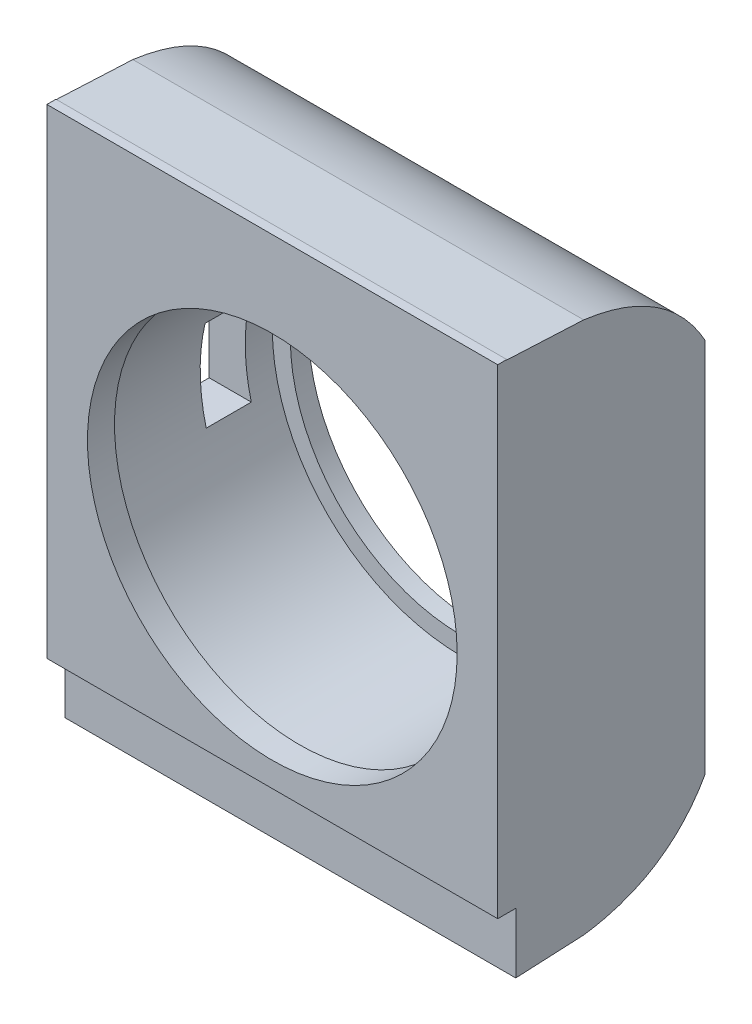
ISO-10303-21;
HEADER;
FILE_DESCRIPTION(('STEP AP214'),'2;1');
FILE_NAME('part.step','',(''),(''),'','','');
FILE_SCHEMA(('AUTOMOTIVE_DESIGN { 1 0 10303 214 1 1 1 1 }'));
ENDSEC;
DATA;
#1=APPLICATION_CONTEXT('core data for automotive mechanical design processes');
#2=APPLICATION_PROTOCOL_DEFINITION('international standard','automotive_design',2000,#1);
#3=PRODUCT_CONTEXT('',#1,'mechanical');
#4=PRODUCT('Part','Part','',(#3));
#5=PRODUCT_RELATED_PRODUCT_CATEGORY('part','',(#4));
#6=PRODUCT_DEFINITION_FORMATION('','',#4);
#7=PRODUCT_DEFINITION_CONTEXT('part definition',#1,'design');
#8=PRODUCT_DEFINITION('design','',#6,#7);
#9=PRODUCT_DEFINITION_SHAPE('','',#8);
#10=(LENGTH_UNIT() NAMED_UNIT(*) SI_UNIT(.MILLI.,.METRE.));
#11=(NAMED_UNIT(*) PLANE_ANGLE_UNIT() SI_UNIT($,.RADIAN.));
#12=(NAMED_UNIT(*) SI_UNIT($,.STERADIAN.) SOLID_ANGLE_UNIT());
#13=UNCERTAINTY_MEASURE_WITH_UNIT(LENGTH_MEASURE(1.E-05),#10,'distance_accuracy_value','');
#14=(GEOMETRIC_REPRESENTATION_CONTEXT(3) GLOBAL_UNCERTAINTY_ASSIGNED_CONTEXT((#13)) GLOBAL_UNIT_ASSIGNED_CONTEXT((#10,
#11,#12)) REPRESENTATION_CONTEXT('',''));
#15=CARTESIAN_POINT('',(0.,0.,0.));
#16=DIRECTION('',(0.,0.,1.));
#17=DIRECTION('',(1.,0.,0.));
#18=AXIS2_PLACEMENT_3D('',#15,#16,#17);
#19=CARTESIAN_POINT('',(25.,30.,23.));
#20=DIRECTION('',(-1.,0.,0.));
#21=DIRECTION('',(0.,-1.,0.));
#22=AXIS2_PLACEMENT_3D('',#19,#20,#21);
#23=PLANE('',#22);
#24=DIRECTION('',(0.,0.,-1.));
#25=VECTOR('',#24,1.);
#26=CARTESIAN_POINT('',(25.,-23.2102553070642,0.));
#27=LINE('',#26,#25);
#28=CARTESIAN_POINT('',(25.,-23.2102553070642,23.));
#29=VERTEX_POINT('',#28);
#30=CARTESIAN_POINT('',(25.,-23.2102553070642,21.));
#31=VERTEX_POINT('',#30);
#32=EDGE_CURVE('E156',#29,#31,#27,.T.);
#33=ORIENTED_EDGE('',*,*,#32,.T.);
#34=DIRECTION('',(0.,1.,0.));
#35=VECTOR('',#34,1.);
#36=CARTESIAN_POINT('',(25.,0.,21.));
#37=LINE('',#36,#35);
#38=CARTESIAN_POINT('',(25.,-29.9040562600047,21.));
#39=VERTEX_POINT('',#38);
#40=EDGE_CURVE('E147',#39,#31,#37,.T.);
#41=ORIENTED_EDGE('',*,*,#40,.F.);
#42=DIRECTION('',(0.,-0.0479167662474689,0.998851332037148));
#43=VECTOR('',#42,1.);
#44=CARTESIAN_POINT('',(25.,-29.5427998082037,13.4694106813302));
#45=LINE('',#44,#43);
#46=CARTESIAN_POINT('',(25.,-29.5427998082037,13.4694106813302));
#47=VERTEX_POINT('',#46);
#48=EDGE_CURVE('E284',#47,#39,#45,.T.);
#49=ORIENTED_EDGE('',*,*,#48,.F.);
#50=CARTESIAN_POINT('',(25.,-20.8431990397707,0.));
#51=CARTESIAN_POINT('',(25.,-28.2896883248181,4.17100932371175));
#52=CARTESIAN_POINT('',(25.,-29.5427998082037,13.4694106813302));
#53=B_SPLINE_CURVE_WITH_KNOTS('',2,(#50,#51,#52),.UNSPECIFIED.,.F.,.F.,(3,3),(0.,1.),.UNSPECIFIED.);
#54=CARTESIAN_POINT('',(25.,-20.8431990397707,0.));
#55=VERTEX_POINT('',#54);
#56=EDGE_CURVE('E230',#55,#47,#53,.T.);
#57=ORIENTED_EDGE('',*,*,#56,.F.);
#58=DIRECTION('',(0.,1.,0.));
#59=VECTOR('',#58,1.);
#60=CARTESIAN_POINT('',(25.,30.,0.));
#61=LINE('',#60,#59);
#62=CARTESIAN_POINT('',(25.,20.8431990397707,0.));
#63=VERTEX_POINT('',#62);
#64=EDGE_CURVE('E301',#55,#63,#61,.T.);
#65=ORIENTED_EDGE('',*,*,#64,.T.);
#66=CARTESIAN_POINT('',(25.,29.5427998082037,13.4694106813302));
#67=CARTESIAN_POINT('',(25.,28.289688324818,4.17100932371175));
#68=CARTESIAN_POINT('',(25.,20.8431990397707,0.));
#69=B_SPLINE_CURVE_WITH_KNOTS('',2,(#66,#67,#68),.UNSPECIFIED.,.F.,.F.,(3,3),(0.,1.),.UNSPECIFIED.);
#70=CARTESIAN_POINT('',(25.,29.5427998082037,13.4694106813302));
#71=VERTEX_POINT('',#70);
#72=EDGE_CURVE('E231',#71,#63,#69,.T.);
#73=ORIENTED_EDGE('',*,*,#72,.F.);
#74=DIRECTION('',(0.,-0.0479167662474689,-0.998851332037148));
#75=VECTOR('',#74,1.);
#76=CARTESIAN_POINT('',(25.,29.5427998082037,13.4694106813302));
#77=LINE('',#76,#75);
#78=CARTESIAN_POINT('',(25.,29.9520281300023,22.));
#79=VERTEX_POINT('',#78);
#80=EDGE_CURVE('E236',#79,#71,#77,.T.);
#81=ORIENTED_EDGE('',*,*,#80,.F.);
#82=DIRECTION('',(0.,-1.,0.));
#83=VECTOR('',#82,1.);
#84=CARTESIAN_POINT('',(25.,0.,22.));
#85=LINE('',#84,#83);
#86=CARTESIAN_POINT('',(25.,30.,22.));
#87=VERTEX_POINT('',#86);
#88=EDGE_CURVE('E184',#87,#79,#85,.T.);
#89=ORIENTED_EDGE('',*,*,#88,.F.);
#90=DIRECTION('',(0.,0.,-1.));
#91=VECTOR('',#90,1.);
#92=CARTESIAN_POINT('',(25.,30.,27.));
#93=LINE('',#92,#91);
#94=CARTESIAN_POINT('',(25.,30.,23.));
#95=VERTEX_POINT('',#94);
#96=EDGE_CURVE('E199',#95,#87,#93,.T.);
#97=ORIENTED_EDGE('',*,*,#96,.F.);
#98=DIRECTION('',(0.,1.,0.));
#99=VECTOR('',#98,1.);
#100=CARTESIAN_POINT('',(25.,30.,23.));
#101=LINE('',#100,#99);
#102=EDGE_CURVE('E169',#29,#95,#101,.T.);
#103=ORIENTED_EDGE('',*,*,#102,.F.);
#104=EDGE_LOOP('',(#33,#41,#49,#57,#65,#73,#81,#89,#97,#103));
#105=FACE_BOUND('',#104,.T.);
#106=ADVANCED_FACE('F47',(#105),#23,.F.);
#107=CARTESIAN_POINT('',(-25.,30.,23.));
#108=DIRECTION('',(1.,0.,0.));
#109=DIRECTION('',(0.,1.,0.));
#110=AXIS2_PLACEMENT_3D('',#107,#108,#109);
#111=PLANE('',#110);
#112=DIRECTION('',(0.,0.,-1.));
#113=VECTOR('',#112,1.);
#114=CARTESIAN_POINT('',(-25.,-5.25747370794527,23.));
#115=LINE('',#114,#113);
#116=CARTESIAN_POINT('',(-25.,-5.25747370794527,10.));
#117=VERTEX_POINT('',#116);
#118=CARTESIAN_POINT('',(-25.,-5.25747370794527,5.));
#119=VERTEX_POINT('',#118);
#120=EDGE_CURVE('E336',#117,#119,#115,.T.);
#121=ORIENTED_EDGE('',*,*,#120,.T.);
#122=DIRECTION('',(0.,1.,0.));
#123=VECTOR('',#122,1.);
#124=CARTESIAN_POINT('',(-25.,30.,5.));
#125=LINE('',#124,#123);
#126=CARTESIAN_POINT('',(-25.,4.74252629205473,5.));
#127=VERTEX_POINT('',#126);
#128=EDGE_CURVE('E340',#119,#127,#125,.T.);
#129=ORIENTED_EDGE('',*,*,#128,.T.);
#130=DIRECTION('',(0.,0.,1.));
#131=VECTOR('',#130,1.);
#132=CARTESIAN_POINT('',(-25.,4.74252629205473,23.));
#133=LINE('',#132,#131);
#134=CARTESIAN_POINT('',(-25.,4.74252629205473,10.));
#135=VERTEX_POINT('',#134);
#136=EDGE_CURVE('E328',#127,#135,#133,.T.);
#137=ORIENTED_EDGE('',*,*,#136,.T.);
#138=DIRECTION('',(0.,-1.,0.));
#139=VECTOR('',#138,1.);
#140=CARTESIAN_POINT('',(-25.,30.,10.));
#141=LINE('',#140,#139);
#142=EDGE_CURVE('E332',#135,#117,#141,.T.);
#143=ORIENTED_EDGE('',*,*,#142,.T.);
#144=EDGE_LOOP('',(#121,#129,#137,#143));
#145=FACE_BOUND('',#144,.T.);
#146=DIRECTION('',(0.,0.,-1.));
#147=VECTOR('',#146,1.);
#148=CARTESIAN_POINT('',(-25.,-23.2102553070642,0.));
#149=LINE('',#148,#147);
#150=CARTESIAN_POINT('',(-25.,-23.2102553070642,23.));
#151=VERTEX_POINT('',#150);
#152=CARTESIAN_POINT('',(-25.,-23.2102553070642,21.));
#153=VERTEX_POINT('',#152);
#154=EDGE_CURVE('E163',#151,#153,#149,.T.);
#155=ORIENTED_EDGE('',*,*,#154,.F.);
#156=DIRECTION('',(0.,-1.,0.));
#157=VECTOR('',#156,1.);
#158=CARTESIAN_POINT('',(-25.,30.,23.));
#159=LINE('',#158,#157);
#160=CARTESIAN_POINT('',(-25.,30.,23.));
#161=VERTEX_POINT('',#160);
#162=EDGE_CURVE('E320',#161,#151,#159,.T.);
#163=ORIENTED_EDGE('',*,*,#162,.F.);
#164=DIRECTION('',(0.,0.,-1.));
#165=VECTOR('',#164,1.);
#166=CARTESIAN_POINT('',(-25.,30.,27.));
#167=LINE('',#166,#165);
#168=CARTESIAN_POINT('',(-25.,30.,22.));
#169=VERTEX_POINT('',#168);
#170=EDGE_CURVE('E196',#161,#169,#167,.T.);
#171=ORIENTED_EDGE('',*,*,#170,.T.);
#172=DIRECTION('',(0.,-1.,0.));
#173=VECTOR('',#172,1.);
#174=CARTESIAN_POINT('',(-25.,0.,22.));
#175=LINE('',#174,#173);
#176=CARTESIAN_POINT('',(-25.,29.9520281300023,22.));
#177=VERTEX_POINT('',#176);
#178=EDGE_CURVE('E192',#169,#177,#175,.T.);
#179=ORIENTED_EDGE('',*,*,#178,.T.);
#180=DIRECTION('',(0.,-0.0479167662474689,-0.998851332037148));
#181=VECTOR('',#180,1.);
#182=CARTESIAN_POINT('',(-25.,29.5427998082037,13.4694106813302));
#183=LINE('',#182,#181);
#184=CARTESIAN_POINT('',(-25.,29.5427998082037,13.4694106813302));
#185=VERTEX_POINT('',#184);
#186=EDGE_CURVE('E250',#177,#185,#183,.T.);
#187=ORIENTED_EDGE('',*,*,#186,.T.);
#188=CARTESIAN_POINT('',(-25.,29.5427998082037,13.4694106813302));
#189=CARTESIAN_POINT('',(-25.,28.289688324818,4.17100932371175));
#190=CARTESIAN_POINT('',(-25.,20.8431990397707,0.));
#191=B_SPLINE_CURVE_WITH_KNOTS('',2,(#188,#189,#190),.UNSPECIFIED.,.F.,.F.,(3,3),(0.,1.),.UNSPECIFIED.);
#192=CARTESIAN_POINT('',(-25.,20.8431990397707,0.));
#193=VERTEX_POINT('',#192);
#194=EDGE_CURVE('E243',#185,#193,#191,.T.);
#195=ORIENTED_EDGE('',*,*,#194,.T.);
#196=DIRECTION('',(0.,-1.,0.));
#197=VECTOR('',#196,1.);
#198=CARTESIAN_POINT('',(-25.,30.,0.));
#199=LINE('',#198,#197);
#200=CARTESIAN_POINT('',(-25.,-20.8431990397707,0.));
#201=VERTEX_POINT('',#200);
#202=EDGE_CURVE('E297',#193,#201,#199,.T.);
#203=ORIENTED_EDGE('',*,*,#202,.T.);
#204=CARTESIAN_POINT('',(-25.,-20.8431990397707,0.));
#205=CARTESIAN_POINT('',(-25.,-28.2896883248181,4.17100932371175));
#206=CARTESIAN_POINT('',(-25.,-29.5427998082037,13.4694106813302));
#207=B_SPLINE_CURVE_WITH_KNOTS('',2,(#204,#205,#206),.UNSPECIFIED.,.F.,.F.,(3,3),(0.,1.),.UNSPECIFIED.);
#208=CARTESIAN_POINT('',(-25.,-29.5427998082037,13.4694106813302));
#209=VERTEX_POINT('',#208);
#210=EDGE_CURVE('E275',#201,#209,#207,.T.);
#211=ORIENTED_EDGE('',*,*,#210,.T.);
#212=DIRECTION('',(0.,-0.0479167662474689,0.998851332037148));
#213=VECTOR('',#212,1.);
#214=CARTESIAN_POINT('',(-25.,-29.5427998082037,13.4694106813302));
#215=LINE('',#214,#213);
#216=CARTESIAN_POINT('',(-25.,-29.9040562600047,21.));
#217=VERTEX_POINT('',#216);
#218=EDGE_CURVE('E283',#209,#217,#215,.T.);
#219=ORIENTED_EDGE('',*,*,#218,.T.);
#220=DIRECTION('',(0.,1.,0.));
#221=VECTOR('',#220,1.);
#222=CARTESIAN_POINT('',(-25.,0.,21.));
#223=LINE('',#222,#221);
#224=EDGE_CURVE('E64',#217,#153,#223,.T.);
#225=ORIENTED_EDGE('',*,*,#224,.T.);
#226=EDGE_LOOP('',(#155,#163,#171,#179,#187,#195,#203,#211,#219,#225));
#227=FACE_BOUND('',#226,.T.);
#228=ADVANCED_FACE('F351',(#145,#227),#111,.F.);
#229=CARTESIAN_POINT('',(0.,0.,23.));
#230=DIRECTION('',(0.,0.,1.));
#231=DIRECTION('',(1.,0.,0.));
#232=AXIS2_PLACEMENT_3D('',#229,#230,#231);
#233=PLANE('',#232);
#234=CARTESIAN_POINT('',(0.,0.,23.));
#235=DIRECTION('',(0.,0.,1.));
#236=DIRECTION('',(1.,0.,0.));
#237=AXIS2_PLACEMENT_3D('',#234,#235,#236);
#238=CIRCLE('',#237,20.5);
#239=CARTESIAN_POINT('',(20.5,0.,23.));
#240=VERTEX_POINT('',#239);
#241=EDGE_CURVE('E307',#240,#240,#238,.T.);
#242=ORIENTED_EDGE('',*,*,#241,.F.);
#243=EDGE_LOOP('',(#242));
#244=FACE_BOUND('',#243,.T.);
#245=ORIENTED_EDGE('',*,*,#162,.T.);
#246=DIRECTION('',(1.,0.,0.));
#247=VECTOR('',#246,1.);
#248=CARTESIAN_POINT('',(-25.,-23.2102553070642,23.));
#249=LINE('',#248,#247);
#250=EDGE_CURVE('E165',#151,#29,#249,.T.);
#251=ORIENTED_EDGE('',*,*,#250,.T.);
#252=ORIENTED_EDGE('',*,*,#102,.T.);
#253=DIRECTION('',(1.,0.,0.));
#254=VECTOR('',#253,1.);
#255=CARTESIAN_POINT('',(0.,30.,23.));
#256=LINE('',#255,#254);
#257=EDGE_CURVE('E179',#161,#95,#256,.T.);
#258=ORIENTED_EDGE('',*,*,#257,.F.);
#259=EDGE_LOOP('',(#245,#251,#252,#258));
#260=FACE_BOUND('',#259,.T.);
#261=ADVANCED_FACE('F380',(#244,#260),#233,.T.);
#262=CARTESIAN_POINT('',(0.,30.,27.));
#263=DIRECTION('',(0.,1.,0.));
#264=DIRECTION('',(0.,0.,1.));
#265=AXIS2_PLACEMENT_3D('',#262,#263,#264);
#266=PLANE('',#265);
#267=ORIENTED_EDGE('',*,*,#170,.F.);
#268=ORIENTED_EDGE('',*,*,#257,.T.);
#269=ORIENTED_EDGE('',*,*,#96,.T.);
#270=DIRECTION('',(1.,0.,0.));
#271=VECTOR('',#270,1.);
#272=CARTESIAN_POINT('',(0.,30.,22.));
#273=LINE('',#272,#271);
#274=EDGE_CURVE('E188',#169,#87,#273,.T.);
#275=ORIENTED_EDGE('',*,*,#274,.F.);
#276=EDGE_LOOP('',(#267,#268,#269,#275));
#277=FACE_BOUND('',#276,.T.);
#278=ADVANCED_FACE('F356',(#277),#266,.T.);
#279=CARTESIAN_POINT('',(-25.,29.5427998082037,13.4694106813302));
#280=DIRECTION('',(0.,-0.998851332037148,0.0479167662474689));
#281=DIRECTION('',(0.,-0.0479167662474689,-0.998851332037148));
#282=AXIS2_PLACEMENT_3D('',#279,#280,#281);
#283=PLANE('',#282);
#284=DIRECTION('',(-1.,0.,0.));
#285=VECTOR('',#284,1.);
#286=CARTESIAN_POINT('',(-25.,29.9520281300023,22.));
#287=LINE('',#286,#285);
#288=EDGE_CURVE('E57',#79,#177,#287,.T.);
#289=ORIENTED_EDGE('',*,*,#288,.F.);
#290=ORIENTED_EDGE('',*,*,#80,.T.);
#291=DIRECTION('',(1.,0.,0.));
#292=VECTOR('',#291,1.);
#293=CARTESIAN_POINT('',(-25.,29.5427998082037,13.4694106813302));
#294=LINE('',#293,#292);
#295=EDGE_CURVE('E302',#185,#71,#294,.T.);
#296=ORIENTED_EDGE('',*,*,#295,.F.);
#297=ORIENTED_EDGE('',*,*,#186,.F.);
#298=EDGE_LOOP('',(#289,#290,#296,#297));
#299=FACE_BOUND('',#298,.T.);
#300=ADVANCED_FACE('F263',(#299),#283,.F.);
#301=CARTESIAN_POINT('',(0.,0.,2.));
#302=DIRECTION('',(0.,0.,1.));
#303=DIRECTION('',(1.,0.,0.));
#304=AXIS2_PLACEMENT_3D('',#301,#302,#303);
#305=PLANE('',#304);
#306=CARTESIAN_POINT('',(0.,0.,2.));
#307=DIRECTION('',(0.,0.,1.));
#308=DIRECTION('',(1.,0.,0.));
#309=AXIS2_PLACEMENT_3D('',#306,#307,#308);
#310=CIRCLE('',#309,19.);
#311=CARTESIAN_POINT('',(19.,0.,2.));
#312=VERTEX_POINT('',#311);
#313=EDGE_CURVE('E157',#312,#312,#310,.T.);
#314=ORIENTED_EDGE('',*,*,#313,.F.);
#315=EDGE_LOOP('',(#314));
#316=FACE_BOUND('',#315,.T.);
#317=CARTESIAN_POINT('',(0.,0.,2.));
#318=DIRECTION('',(0.,0.,1.));
#319=DIRECTION('',(1.,0.,0.));
#320=AXIS2_PLACEMENT_3D('',#317,#318,#319);
#321=CIRCLE('',#320,21.);
#322=CARTESIAN_POINT('',(21.,0.,2.));
#323=VERTEX_POINT('',#322);
#324=EDGE_CURVE('E324',#323,#323,#321,.F.);
#325=ORIENTED_EDGE('',*,*,#324,.F.);
#326=EDGE_LOOP('',(#325));
#327=FACE_BOUND('',#326,.T.);
#328=ADVANCED_FACE('F401',(#316,#327),#305,.T.);
#329=CARTESIAN_POINT('',(0.,0.,0.));
#330=DIRECTION('',(0.,0.,1.));
#331=DIRECTION('',(1.,0.,0.));
#332=AXIS2_PLACEMENT_3D('',#329,#330,#331);
#333=PLANE('',#332);
#334=CARTESIAN_POINT('',(0.,0.,0.));
#335=DIRECTION('',(0.,0.,1.));
#336=DIRECTION('',(1.,0.,0.));
#337=AXIS2_PLACEMENT_3D('',#334,#335,#336);
#338=CIRCLE('',#337,19.);
#339=CARTESIAN_POINT('',(19.,0.,0.));
#340=VERTEX_POINT('',#339);
#341=EDGE_CURVE('E51',#340,#340,#338,.T.);
#342=ORIENTED_EDGE('',*,*,#341,.T.);
#343=EDGE_LOOP('',(#342));
#344=FACE_BOUND('',#343,.T.);
#345=ORIENTED_EDGE('',*,*,#202,.F.);
#346=DIRECTION('',(1.,0.,0.));
#347=VECTOR('',#346,1.);
#348=CARTESIAN_POINT('',(-25.,20.8431990397707,0.));
#349=LINE('',#348,#347);
#350=EDGE_CURVE('E362',#193,#63,#349,.T.);
#351=ORIENTED_EDGE('',*,*,#350,.T.);
#352=ORIENTED_EDGE('',*,*,#64,.F.);
#353=DIRECTION('',(1.,0.,0.));
#354=VECTOR('',#353,1.);
#355=CARTESIAN_POINT('',(-25.,-20.8431990397707,0.));
#356=LINE('',#355,#354);
#357=EDGE_CURVE('E292',#201,#55,#356,.T.);
#358=ORIENTED_EDGE('',*,*,#357,.F.);
#359=EDGE_LOOP('',(#345,#351,#352,#358));
#360=FACE_BOUND('',#359,.T.);
#361=ADVANCED_FACE('F49',(#344,#360),#333,.F.);
#362=CARTESIAN_POINT('',(0.,0.,20.));
#363=DIRECTION('',(0.,0.,-1.));
#364=DIRECTION('',(-1.,0.,0.));
#365=AXIS2_PLACEMENT_3D('',#362,#363,#364);
#366=CYLINDRICAL_SURFACE('',#365,21.);
#367=CARTESIAN_POINT('',(0.,0.,5.));
#368=DIRECTION('',(0.,0.,-1.));
#369=DIRECTION('',(-1.,0.,0.));
#370=AXIS2_PLACEMENT_3D('',#367,#368,#369);
#371=CIRCLE('',#370,21.);
#372=CARTESIAN_POINT('',(-20.3312313992602,-5.25747370794527,5.));
#373=VERTEX_POINT('',#372);
#374=CARTESIAN_POINT('',(-20.4574789348338,4.74252629205473,5.));
#375=VERTEX_POINT('',#374);
#376=EDGE_CURVE('E226',#373,#375,#371,.T.);
#377=ORIENTED_EDGE('',*,*,#376,.F.);
#378=DIRECTION('',(0.,0.,-1.));
#379=VECTOR('',#378,1.);
#380=CARTESIAN_POINT('',(-20.3312313992602,-5.25747370794527,20.));
#381=LINE('',#380,#379);
#382=CARTESIAN_POINT('',(-20.3312313992602,-5.25747370794527,10.));
#383=VERTEX_POINT('',#382);
#384=EDGE_CURVE('E223',#383,#373,#381,.T.);
#385=ORIENTED_EDGE('',*,*,#384,.F.);
#386=CARTESIAN_POINT('',(0.,0.,10.));
#387=DIRECTION('',(0.,0.,1.));
#388=DIRECTION('',(1.,0.,0.));
#389=AXIS2_PLACEMENT_3D('',#386,#387,#388);
#390=CIRCLE('',#389,21.);
#391=CARTESIAN_POINT('',(-20.4574789348338,4.74252629205473,10.));
#392=VERTEX_POINT('',#391);
#393=EDGE_CURVE('E220',#392,#383,#390,.T.);
#394=ORIENTED_EDGE('',*,*,#393,.F.);
#395=DIRECTION('',(0.,0.,-1.));
#396=VECTOR('',#395,1.);
#397=CARTESIAN_POINT('',(-20.4574789348338,4.74252629205473,20.));
#398=LINE('',#397,#396);
#399=EDGE_CURVE('E207',#375,#392,#398,.F.);
#400=ORIENTED_EDGE('',*,*,#399,.F.);
#401=EDGE_LOOP('',(#377,#385,#394,#400));
#402=FACE_BOUND('',#401,.T.);
#403=ORIENTED_EDGE('',*,*,#324,.T.);
#404=EDGE_LOOP('',(#403));
#405=FACE_BOUND('',#404,.T.);
#406=CARTESIAN_POINT('',(0.,0.,20.));
#407=DIRECTION('',(0.,0.,1.));
#408=DIRECTION('',(1.,0.,0.));
#409=AXIS2_PLACEMENT_3D('',#406,#407,#408);
#410=CIRCLE('',#409,21.);
#411=CARTESIAN_POINT('',(21.,0.,20.));
#412=VERTEX_POINT('',#411);
#413=EDGE_CURVE('E311',#412,#412,#410,.T.);
#414=ORIENTED_EDGE('',*,*,#413,.T.);
#415=EDGE_LOOP('',(#414));
#416=FACE_BOUND('',#415,.T.);
#417=ADVANCED_FACE('F397',(#402,#405,#416),#366,.F.);
#418=CARTESIAN_POINT('',(0.,0.,20.));
#419=DIRECTION('',(0.,0.,1.));
#420=DIRECTION('',(1.,0.,0.));
#421=AXIS2_PLACEMENT_3D('',#418,#419,#420);
#422=PLANE('',#421);
#423=ORIENTED_EDGE('',*,*,#413,.F.);
#424=EDGE_LOOP('',(#423));
#425=FACE_BOUND('',#424,.T.);
#426=CARTESIAN_POINT('',(0.,0.,20.));
#427=DIRECTION('',(0.,0.,1.));
#428=DIRECTION('',(1.,0.,0.));
#429=AXIS2_PLACEMENT_3D('',#426,#427,#428);
#430=CIRCLE('',#429,20.5);
#431=CARTESIAN_POINT('',(20.5,0.,20.));
#432=VERTEX_POINT('',#431);
#433=EDGE_CURVE('E306',#432,#432,#430,.T.);
#434=ORIENTED_EDGE('',*,*,#433,.T.);
#435=EDGE_LOOP('',(#434));
#436=FACE_BOUND('',#435,.T.);
#437=ADVANCED_FACE('F399',(#425,#436),#422,.F.);
#438=CARTESIAN_POINT('',(0.,0.,23.));
#439=DIRECTION('',(0.,0.,-1.));
#440=DIRECTION('',(-1.,0.,0.));
#441=AXIS2_PLACEMENT_3D('',#438,#439,#440);
#442=CYLINDRICAL_SURFACE('',#441,20.5);
#443=ORIENTED_EDGE('',*,*,#241,.T.);
#444=EDGE_LOOP('',(#443));
#445=FACE_BOUND('',#444,.T.);
#446=ORIENTED_EDGE('',*,*,#433,.F.);
#447=EDGE_LOOP('',(#446));
#448=FACE_BOUND('',#447,.T.);
#449=ADVANCED_FACE('F268',(#445,#448),#442,.F.);
#450=CARTESIAN_POINT('',(-25.,-29.5427998082037,13.4694106813302));
#451=DIRECTION('',(0.,0.998851332037148,0.0479167662474689));
#452=DIRECTION('',(0.,-0.0479167662474689,0.998851332037148));
#453=AXIS2_PLACEMENT_3D('',#450,#451,#452);
#454=PLANE('',#453);
#455=ORIENTED_EDGE('',*,*,#48,.T.);
#456=DIRECTION('',(-1.,0.,0.));
#457=VECTOR('',#456,1.);
#458=CARTESIAN_POINT('',(-25.,-29.9040562600047,21.));
#459=LINE('',#458,#457);
#460=EDGE_CURVE('E12',#39,#217,#459,.T.);
#461=ORIENTED_EDGE('',*,*,#460,.T.);
#462=ORIENTED_EDGE('',*,*,#218,.F.);
#463=DIRECTION('',(1.,0.,0.));
#464=VECTOR('',#463,1.);
#465=CARTESIAN_POINT('',(-25.,-29.5427998082037,13.4694106813302));
#466=LINE('',#465,#464);
#467=EDGE_CURVE('E237',#209,#47,#466,.T.);
#468=ORIENTED_EDGE('',*,*,#467,.T.);
#469=EDGE_LOOP('',(#455,#461,#462,#468));
#470=FACE_BOUND('',#469,.T.);
#471=ADVANCED_FACE('F265',(#470),#454,.F.);
#472=DIRECTION('',(1.,0.,0.));
#473=VECTOR('',#472,1.);
#474=SURFACE_OF_LINEAR_EXTRUSION('',#207,#473);
#475=ORIENTED_EDGE('',*,*,#467,.F.);
#476=ORIENTED_EDGE('',*,*,#210,.F.);
#477=ORIENTED_EDGE('',*,*,#357,.T.);
#478=ORIENTED_EDGE('',*,*,#56,.T.);
#479=EDGE_LOOP('',(#475,#476,#477,#478));
#480=FACE_BOUND('',#479,.T.);
#481=ADVANCED_FACE('F261',(#480),#474,.F.);
#482=DIRECTION('',(1.,0.,0.));
#483=VECTOR('',#482,1.);
#484=SURFACE_OF_LINEAR_EXTRUSION('',#191,#483);
#485=ORIENTED_EDGE('',*,*,#350,.F.);
#486=ORIENTED_EDGE('',*,*,#194,.F.);
#487=ORIENTED_EDGE('',*,*,#295,.T.);
#488=ORIENTED_EDGE('',*,*,#72,.T.);
#489=EDGE_LOOP('',(#485,#486,#487,#488));
#490=FACE_BOUND('',#489,.T.);
#491=ADVANCED_FACE('F256',(#490),#484,.F.);
#492=CARTESIAN_POINT('',(-30.,4.74252629205473,5.));
#493=DIRECTION('',(0.,0.,-1.));
#494=DIRECTION('',(-1.,0.,0.));
#495=AXIS2_PLACEMENT_3D('',#492,#493,#494);
#496=PLANE('',#495);
#497=ORIENTED_EDGE('',*,*,#376,.T.);
#498=DIRECTION('',(1.,0.,0.));
#499=VECTOR('',#498,1.);
#500=CARTESIAN_POINT('',(-30.,4.74252629205473,5.));
#501=LINE('',#500,#499);
#502=EDGE_CURVE('E202',#127,#375,#501,.T.);
#503=ORIENTED_EDGE('',*,*,#502,.F.);
#504=ORIENTED_EDGE('',*,*,#128,.F.);
#505=DIRECTION('',(1.,0.,0.));
#506=VECTOR('',#505,1.);
#507=CARTESIAN_POINT('',(-30.,-5.25747370794527,5.));
#508=LINE('',#507,#506);
#509=EDGE_CURVE('E203',#119,#373,#508,.T.);
#510=ORIENTED_EDGE('',*,*,#509,.T.);
#511=EDGE_LOOP('',(#497,#503,#504,#510));
#512=FACE_BOUND('',#511,.T.);
#513=ADVANCED_FACE('F260',(#512),#496,.F.);
#514=CARTESIAN_POINT('',(-30.,-5.25747370794527,10.));
#515=DIRECTION('',(0.,-1.,0.));
#516=DIRECTION('',(0.,0.,-1.));
#517=AXIS2_PLACEMENT_3D('',#514,#515,#516);
#518=PLANE('',#517);
#519=ORIENTED_EDGE('',*,*,#384,.T.);
#520=ORIENTED_EDGE('',*,*,#509,.F.);
#521=ORIENTED_EDGE('',*,*,#120,.F.);
#522=DIRECTION('',(1.,0.,0.));
#523=VECTOR('',#522,1.);
#524=CARTESIAN_POINT('',(-30.,-5.25747370794527,10.));
#525=LINE('',#524,#523);
#526=EDGE_CURVE('E208',#117,#383,#525,.T.);
#527=ORIENTED_EDGE('',*,*,#526,.T.);
#528=EDGE_LOOP('',(#519,#520,#521,#527));
#529=FACE_BOUND('',#528,.T.);
#530=ADVANCED_FACE('F447',(#529),#518,.F.);
#531=CARTESIAN_POINT('',(-30.,4.74252629205473,10.));
#532=DIRECTION('',(0.,0.,1.));
#533=DIRECTION('',(1.,0.,0.));
#534=AXIS2_PLACEMENT_3D('',#531,#532,#533);
#535=PLANE('',#534);
#536=ORIENTED_EDGE('',*,*,#393,.T.);
#537=ORIENTED_EDGE('',*,*,#526,.F.);
#538=ORIENTED_EDGE('',*,*,#142,.F.);
#539=DIRECTION('',(1.,0.,0.));
#540=VECTOR('',#539,1.);
#541=CARTESIAN_POINT('',(-30.,4.74252629205473,10.));
#542=LINE('',#541,#540);
#543=EDGE_CURVE('E212',#135,#392,#542,.T.);
#544=ORIENTED_EDGE('',*,*,#543,.T.);
#545=EDGE_LOOP('',(#536,#537,#538,#544));
#546=FACE_BOUND('',#545,.T.);
#547=ADVANCED_FACE('F454',(#546),#535,.F.);
#548=CARTESIAN_POINT('',(-30.,4.74252629205473,10.));
#549=DIRECTION('',(0.,1.,0.));
#550=DIRECTION('',(0.,0.,1.));
#551=AXIS2_PLACEMENT_3D('',#548,#549,#550);
#552=PLANE('',#551);
#553=ORIENTED_EDGE('',*,*,#399,.T.);
#554=ORIENTED_EDGE('',*,*,#543,.F.);
#555=ORIENTED_EDGE('',*,*,#136,.F.);
#556=ORIENTED_EDGE('',*,*,#502,.T.);
#557=EDGE_LOOP('',(#553,#554,#555,#556));
#558=FACE_BOUND('',#557,.T.);
#559=ADVANCED_FACE('F462',(#558),#552,.F.);
#560=CARTESIAN_POINT('',(0.,0.,22.));
#561=DIRECTION('',(0.,0.,1.));
#562=DIRECTION('',(1.,0.,0.));
#563=AXIS2_PLACEMENT_3D('',#560,#561,#562);
#564=PLANE('',#563);
#565=ORIENTED_EDGE('',*,*,#88,.T.);
#566=ORIENTED_EDGE('',*,*,#288,.T.);
#567=ORIENTED_EDGE('',*,*,#178,.F.);
#568=ORIENTED_EDGE('',*,*,#274,.T.);
#569=EDGE_LOOP('',(#565,#566,#567,#568));
#570=FACE_BOUND('',#569,.T.);
#571=ADVANCED_FACE('F347',(#570),#564,.F.);
#572=CARTESIAN_POINT('',(-25.,0.,21.));
#573=DIRECTION('',(0.,0.,-1.));
#574=DIRECTION('',(-1.,0.,0.));
#575=AXIS2_PLACEMENT_3D('',#572,#573,#574);
#576=PLANE('',#575);
#577=ORIENTED_EDGE('',*,*,#40,.T.);
#578=DIRECTION('',(1.,0.,0.));
#579=VECTOR('',#578,1.);
#580=CARTESIAN_POINT('',(-25.,-23.2102553070642,21.));
#581=LINE('',#580,#579);
#582=EDGE_CURVE('E150',#153,#31,#581,.T.);
#583=ORIENTED_EDGE('',*,*,#582,.F.);
#584=ORIENTED_EDGE('',*,*,#224,.F.);
#585=ORIENTED_EDGE('',*,*,#460,.F.);
#586=EDGE_LOOP('',(#577,#583,#584,#585));
#587=FACE_BOUND('',#586,.T.);
#588=ADVANCED_FACE('F149',(#587),#576,.F.);
#589=CARTESIAN_POINT('',(-25.,-23.2102553070642,0.));
#590=DIRECTION('',(0.,-1.,0.));
#591=DIRECTION('',(0.,0.,-1.));
#592=AXIS2_PLACEMENT_3D('',#589,#590,#591);
#593=PLANE('',#592);
#594=ORIENTED_EDGE('',*,*,#250,.F.);
#595=ORIENTED_EDGE('',*,*,#154,.T.);
#596=ORIENTED_EDGE('',*,*,#582,.T.);
#597=ORIENTED_EDGE('',*,*,#32,.F.);
#598=EDGE_LOOP('',(#594,#595,#596,#597));
#599=FACE_BOUND('',#598,.T.);
#600=ADVANCED_FACE('F160',(#599),#593,.T.);
#601=CARTESIAN_POINT('',(0.,0.,-1.2E-05));
#602=DIRECTION('',(0.,0.,1.));
#603=DIRECTION('',(1.,0.,0.));
#604=AXIS2_PLACEMENT_3D('',#601,#602,#603);
#605=CYLINDRICAL_SURFACE('',#604,19.);
#606=ORIENTED_EDGE('',*,*,#313,.T.);
#607=EDGE_LOOP('',(#606));
#608=FACE_BOUND('',#607,.T.);
#609=ORIENTED_EDGE('',*,*,#341,.F.);
#610=EDGE_LOOP('',(#609));
#611=FACE_BOUND('',#610,.T.);
#612=ADVANCED_FACE('F490',(#608,#611),#605,.F.);
#613=CLOSED_SHELL('',(#106,#228,#261,#278,#300,#328,#361,#417,#437,#449,#471,#481,#491,#513,
#530,#547,#559,#571,#588,#600,#612));
#614=MANIFOLD_SOLID_BREP('B2',#613);
#615=ADVANCED_BREP_SHAPE_REPRESENTATION('',(#18,#614),#14);
#616=SHAPE_DEFINITION_REPRESENTATION(#9,#615);
ENDSEC;
END-ISO-10303-21;
